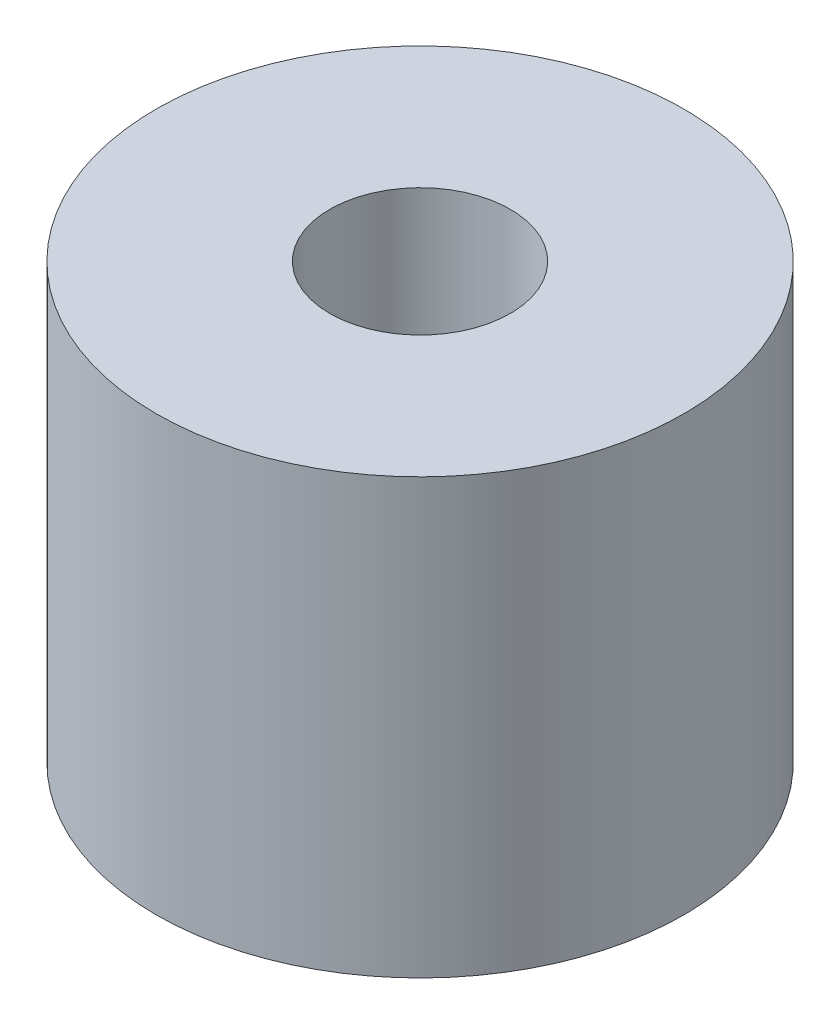
ISO-10303-21;
HEADER;
FILE_DESCRIPTION(('STEP AP214'),'2;1');
FILE_NAME('part.step','',(''),(''),'','','');
FILE_SCHEMA(('AUTOMOTIVE_DESIGN { 1 0 10303 214 1 1 1 1 }'));
ENDSEC;
DATA;
#1=APPLICATION_CONTEXT('core data for automotive mechanical design processes');
#2=APPLICATION_PROTOCOL_DEFINITION('international standard','automotive_design',2000,#1);
#3=PRODUCT_CONTEXT('',#1,'mechanical');
#4=PRODUCT('Part','Part','',(#3));
#5=PRODUCT_RELATED_PRODUCT_CATEGORY('part','',(#4));
#6=PRODUCT_DEFINITION_FORMATION('','',#4);
#7=PRODUCT_DEFINITION_CONTEXT('part definition',#1,'design');
#8=PRODUCT_DEFINITION('design','',#6,#7);
#9=PRODUCT_DEFINITION_SHAPE('','',#8);
#10=(LENGTH_UNIT() NAMED_UNIT(*) SI_UNIT(.MILLI.,.METRE.));
#11=(NAMED_UNIT(*) PLANE_ANGLE_UNIT() SI_UNIT($,.RADIAN.));
#12=(NAMED_UNIT(*) SI_UNIT($,.STERADIAN.) SOLID_ANGLE_UNIT());
#13=UNCERTAINTY_MEASURE_WITH_UNIT(LENGTH_MEASURE(1.E-05),#10,'distance_accuracy_value','');
#14=(GEOMETRIC_REPRESENTATION_CONTEXT(3) GLOBAL_UNCERTAINTY_ASSIGNED_CONTEXT((#13)) GLOBAL_UNIT_ASSIGNED_CONTEXT((#10,
#11,#12)) REPRESENTATION_CONTEXT('',''));
#15=CARTESIAN_POINT('',(0.,0.,0.));
#16=DIRECTION('',(0.,0.,1.));
#17=DIRECTION('',(1.,0.,0.));
#18=AXIS2_PLACEMENT_3D('',#15,#16,#17);
#19=CARTESIAN_POINT('',(0.,12.5,0.));
#20=DIRECTION('',(0.,1.,0.));
#21=DIRECTION('',(0.,0.,1.));
#22=AXIS2_PLACEMENT_3D('',#19,#20,#21);
#23=PLANE('',#22);
#24=CARTESIAN_POINT('',(0.,12.5,0.));
#25=DIRECTION('',(0.,1.,0.));
#26=DIRECTION('',(0.,0.,1.));
#27=AXIS2_PLACEMENT_3D('',#24,#25,#26);
#28=CIRCLE('',#27,7.6);
#29=CARTESIAN_POINT('',(0.,12.5,7.6));
#30=VERTEX_POINT('',#29);
#31=EDGE_CURVE('E10',#30,#30,#28,.T.);
#32=ORIENTED_EDGE('',*,*,#31,.T.);
#33=EDGE_LOOP('',(#32));
#34=FACE_BOUND('',#33,.T.);
#35=CARTESIAN_POINT('',(0.,12.5,0.));
#36=DIRECTION('',(0.,1.,0.));
#37=DIRECTION('',(0.,0.,1.));
#38=AXIS2_PLACEMENT_3D('',#35,#36,#37);
#39=CIRCLE('',#38,2.6);
#40=CARTESIAN_POINT('',(0.,12.5,2.6));
#41=VERTEX_POINT('',#40);
#42=EDGE_CURVE('E53',#41,#41,#39,.T.);
#43=ORIENTED_EDGE('',*,*,#42,.F.);
#44=EDGE_LOOP('',(#43));
#45=FACE_BOUND('',#44,.T.);
#46=ADVANCED_FACE('F39',(#34,#45),#23,.T.);
#47=CARTESIAN_POINT('',(0.,0.,0.));
#48=DIRECTION('',(0.,1.,0.));
#49=DIRECTION('',(0.,0.,1.));
#50=AXIS2_PLACEMENT_3D('',#47,#48,#49);
#51=PLANE('',#50);
#52=CARTESIAN_POINT('',(0.,0.,0.));
#53=DIRECTION('',(0.,1.,0.));
#54=DIRECTION('',(0.,0.,1.));
#55=AXIS2_PLACEMENT_3D('',#52,#53,#54);
#56=CIRCLE('',#55,7.6);
#57=CARTESIAN_POINT('',(0.,0.,7.6));
#58=VERTEX_POINT('',#57);
#59=EDGE_CURVE('E43',#58,#58,#56,.T.);
#60=ORIENTED_EDGE('',*,*,#59,.F.);
#61=EDGE_LOOP('',(#60));
#62=FACE_BOUND('',#61,.T.);
#63=CARTESIAN_POINT('',(0.,0.,0.));
#64=DIRECTION('',(0.,1.,0.));
#65=DIRECTION('',(0.,0.,1.));
#66=AXIS2_PLACEMENT_3D('',#63,#64,#65);
#67=CIRCLE('',#66,2.6);
#68=CARTESIAN_POINT('',(0.,0.,2.6));
#69=VERTEX_POINT('',#68);
#70=EDGE_CURVE('E55',#69,#69,#67,.T.);
#71=ORIENTED_EDGE('',*,*,#70,.T.);
#72=EDGE_LOOP('',(#71));
#73=FACE_BOUND('',#72,.T.);
#74=ADVANCED_FACE('F66',(#62,#73),#51,.F.);
#75=CARTESIAN_POINT('',(0.,12.5,0.));
#76=DIRECTION('',(0.,-1.,0.));
#77=DIRECTION('',(0.,0.,-1.));
#78=AXIS2_PLACEMENT_3D('',#75,#76,#77);
#79=CYLINDRICAL_SURFACE('',#78,7.6);
#80=ORIENTED_EDGE('',*,*,#31,.F.);
#81=EDGE_LOOP('',(#80));
#82=FACE_BOUND('',#81,.T.);
#83=ORIENTED_EDGE('',*,*,#59,.T.);
#84=EDGE_LOOP('',(#83));
#85=FACE_BOUND('',#84,.T.);
#86=ADVANCED_FACE('F41',(#82,#85),#79,.T.);
#87=CARTESIAN_POINT('',(0.,12.5,0.));
#88=DIRECTION('',(0.,-1.,0.));
#89=DIRECTION('',(0.,0.,-1.));
#90=AXIS2_PLACEMENT_3D('',#87,#88,#89);
#91=CYLINDRICAL_SURFACE('',#90,2.6);
#92=ORIENTED_EDGE('',*,*,#42,.T.);
#93=EDGE_LOOP('',(#92));
#94=FACE_BOUND('',#93,.T.);
#95=ORIENTED_EDGE('',*,*,#70,.F.);
#96=EDGE_LOOP('',(#95));
#97=FACE_BOUND('',#96,.T.);
#98=ADVANCED_FACE('F62',(#94,#97),#91,.F.);
#99=CLOSED_SHELL('',(#46,#74,#86,#98));
#100=MANIFOLD_SOLID_BREP('B2',#99);
#101=ADVANCED_BREP_SHAPE_REPRESENTATION('',(#18,#100),#14);
#102=SHAPE_DEFINITION_REPRESENTATION(#9,#101);
ENDSEC;
END-ISO-10303-21;
